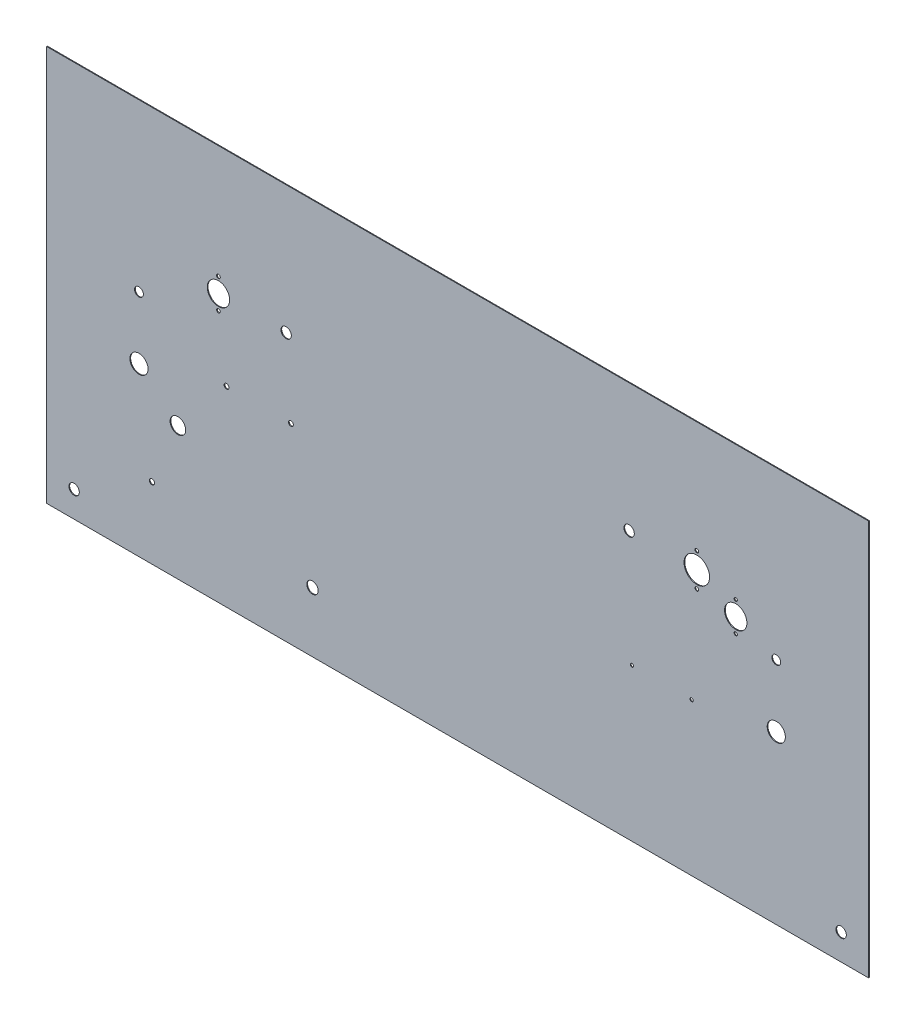
ISO-10303-21;
HEADER;
FILE_DESCRIPTION(('STEP AP214'),'2;1');
FILE_NAME('part.step','',(''),(''),'','','');
FILE_SCHEMA(('AUTOMOTIVE_DESIGN { 1 0 10303 214 1 1 1 1 }'));
ENDSEC;
DATA;
#1=APPLICATION_CONTEXT('core data for automotive mechanical design processes');
#2=APPLICATION_PROTOCOL_DEFINITION('international standard','automotive_design',2000,#1);
#3=PRODUCT_CONTEXT('',#1,'mechanical');
#4=PRODUCT('Part','Part','',(#3));
#5=PRODUCT_RELATED_PRODUCT_CATEGORY('part','',(#4));
#6=PRODUCT_DEFINITION_FORMATION('','',#4);
#7=PRODUCT_DEFINITION_CONTEXT('part definition',#1,'design');
#8=PRODUCT_DEFINITION('design','',#6,#7);
#9=PRODUCT_DEFINITION_SHAPE('','',#8);
#10=(LENGTH_UNIT() NAMED_UNIT(*) SI_UNIT(.MILLI.,.METRE.));
#11=(NAMED_UNIT(*) PLANE_ANGLE_UNIT() SI_UNIT($,.RADIAN.));
#12=(NAMED_UNIT(*) SI_UNIT($,.STERADIAN.) SOLID_ANGLE_UNIT());
#13=UNCERTAINTY_MEASURE_WITH_UNIT(LENGTH_MEASURE(1.E-05),#10,'distance_accuracy_value','');
#14=(GEOMETRIC_REPRESENTATION_CONTEXT(3) GLOBAL_UNCERTAINTY_ASSIGNED_CONTEXT((#13)) GLOBAL_UNIT_ASSIGNED_CONTEXT((#10,
#11,#12)) REPRESENTATION_CONTEXT('',''));
#15=CARTESIAN_POINT('',(0.,0.,0.));
#16=DIRECTION('',(0.,0.,1.));
#17=DIRECTION('',(1.,0.,0.));
#18=AXIS2_PLACEMENT_3D('',#15,#16,#17);
#19=CARTESIAN_POINT('',(777.875,4.4590924759535E-13,0.7366));
#20=DIRECTION('',(1.,0.,0.));
#21=DIRECTION('',(0.,1.,0.));
#22=AXIS2_PLACEMENT_3D('',#19,#20,#21);
#23=PLANE('',#22);
#24=DIRECTION('',(0.,-1.,0.));
#25=VECTOR('',#24,1.);
#26=CARTESIAN_POINT('',(777.875,4.4590924759535E-13,0.));
#27=LINE('',#26,#25);
#28=CARTESIAN_POINT('',(777.875,361.95,0.));
#29=VERTEX_POINT('',#28);
#30=CARTESIAN_POINT('',(777.875,-25.3999999999999,0.));
#31=VERTEX_POINT('',#30);
#32=EDGE_CURVE('E385',#29,#31,#27,.T.);
#33=ORIENTED_EDGE('',*,*,#32,.F.);
#34=DIRECTION('',(0.,0.,-1.));
#35=VECTOR('',#34,1.);
#36=CARTESIAN_POINT('',(777.875,361.95,0.7366));
#37=LINE('',#36,#35);
#38=CARTESIAN_POINT('',(777.875,361.95,0.7366));
#39=VERTEX_POINT('',#38);
#40=EDGE_CURVE('E12',#39,#29,#37,.T.);
#41=ORIENTED_EDGE('',*,*,#40,.F.);
#42=DIRECTION('',(0.,-1.,0.));
#43=VECTOR('',#42,1.);
#44=CARTESIAN_POINT('',(777.875,4.4590924759535E-13,0.7366));
#45=LINE('',#44,#43);
#46=CARTESIAN_POINT('',(777.875,-25.3999999999999,0.7366));
#47=VERTEX_POINT('',#46);
#48=EDGE_CURVE('E97',#39,#47,#45,.T.);
#49=ORIENTED_EDGE('',*,*,#48,.T.);
#50=DIRECTION('',(0.,0.,-1.));
#51=VECTOR('',#50,1.);
#52=CARTESIAN_POINT('',(777.875,-25.3999999999999,0.7366));
#53=LINE('',#52,#51);
#54=EDGE_CURVE('E79',#47,#31,#53,.T.);
#55=ORIENTED_EDGE('',*,*,#54,.T.);
#56=EDGE_LOOP('',(#33,#41,#49,#55));
#57=FACE_BOUND('',#56,.T.);
#58=ADVANCED_FACE('F40',(#57),#23,.T.);
#59=CARTESIAN_POINT('',(0.,361.95,0.7366));
#60=DIRECTION('',(0.,1.,0.));
#61=DIRECTION('',(0.,0.,1.));
#62=AXIS2_PLACEMENT_3D('',#59,#60,#61);
#63=PLANE('',#62);
#64=DIRECTION('',(1.,0.,0.));
#65=VECTOR('',#64,1.);
#66=CARTESIAN_POINT('',(0.,361.95,0.));
#67=LINE('',#66,#65);
#68=CARTESIAN_POINT('',(-26.9875,361.95,0.));
#69=VERTEX_POINT('',#68);
#70=EDGE_CURVE('E90',#69,#29,#67,.T.);
#71=ORIENTED_EDGE('',*,*,#70,.F.);
#72=DIRECTION('',(0.,0.,-1.));
#73=VECTOR('',#72,1.);
#74=CARTESIAN_POINT('',(-26.9875,361.95,0.7366));
#75=LINE('',#74,#73);
#76=CARTESIAN_POINT('',(-26.9875,361.95,0.7366));
#77=VERTEX_POINT('',#76);
#78=EDGE_CURVE('E49',#77,#69,#75,.T.);
#79=ORIENTED_EDGE('',*,*,#78,.F.);
#80=DIRECTION('',(1.,0.,0.));
#81=VECTOR('',#80,1.);
#82=CARTESIAN_POINT('',(0.,361.95,0.7366));
#83=LINE('',#82,#81);
#84=EDGE_CURVE('E88',#77,#39,#83,.T.);
#85=ORIENTED_EDGE('',*,*,#84,.T.);
#86=ORIENTED_EDGE('',*,*,#40,.T.);
#87=EDGE_LOOP('',(#71,#79,#85,#86));
#88=FACE_BOUND('',#87,.T.);
#89=ADVANCED_FACE('F87',(#88),#63,.T.);
#90=CARTESIAN_POINT('',(-26.9875,0.,0.7366));
#91=DIRECTION('',(-1.,0.,0.));
#92=DIRECTION('',(0.,-1.,0.));
#93=AXIS2_PLACEMENT_3D('',#90,#91,#92);
#94=PLANE('',#93);
#95=DIRECTION('',(0.,1.,0.));
#96=VECTOR('',#95,1.);
#97=CARTESIAN_POINT('',(-26.9875,0.,0.));
#98=LINE('',#97,#96);
#99=CARTESIAN_POINT('',(-26.9875,-25.4,0.));
#100=VERTEX_POINT('',#99);
#101=EDGE_CURVE('E396',#100,#69,#98,.T.);
#102=ORIENTED_EDGE('',*,*,#101,.F.);
#103=DIRECTION('',(0.,0.,-1.));
#104=VECTOR('',#103,1.);
#105=CARTESIAN_POINT('',(-26.9875,-25.4,0.7366));
#106=LINE('',#105,#104);
#107=CARTESIAN_POINT('',(-26.9875,-25.4,0.7366));
#108=VERTEX_POINT('',#107);
#109=EDGE_CURVE('E72',#108,#100,#106,.T.);
#110=ORIENTED_EDGE('',*,*,#109,.F.);
#111=DIRECTION('',(0.,1.,0.));
#112=VECTOR('',#111,1.);
#113=CARTESIAN_POINT('',(-26.9875,0.,0.7366));
#114=LINE('',#113,#112);
#115=EDGE_CURVE('E96',#108,#77,#114,.T.);
#116=ORIENTED_EDGE('',*,*,#115,.T.);
#117=ORIENTED_EDGE('',*,*,#78,.T.);
#118=EDGE_LOOP('',(#102,#110,#116,#117));
#119=FACE_BOUND('',#118,.T.);
#120=ADVANCED_FACE('F100',(#119),#94,.T.);
#121=CARTESIAN_POINT('',(0.,0.,0.7366));
#122=DIRECTION('',(0.,0.,-1.));
#123=DIRECTION('',(-1.,0.,0.));
#124=AXIS2_PLACEMENT_3D('',#121,#122,#123);
#125=CYLINDRICAL_SURFACE('',#124,5.08);
#126=CARTESIAN_POINT('',(0.,0.,0.7366));
#127=DIRECTION('',(0.,0.,1.));
#128=DIRECTION('',(1.,0.,0.));
#129=AXIS2_PLACEMENT_3D('',#126,#127,#128);
#130=CIRCLE('',#129,5.08);
#131=CARTESIAN_POINT('',(5.08,0.,0.7366));
#132=VERTEX_POINT('',#131);
#133=EDGE_CURVE('E116',#132,#132,#130,.T.);
#134=ORIENTED_EDGE('',*,*,#133,.T.);
#135=EDGE_LOOP('',(#134));
#136=FACE_BOUND('',#135,.T.);
#137=CARTESIAN_POINT('',(0.,0.,0.));
#138=DIRECTION('',(0.,0.,1.));
#139=DIRECTION('',(1.,0.,0.));
#140=AXIS2_PLACEMENT_3D('',#137,#138,#139);
#141=CIRCLE('',#140,5.08);
#142=CARTESIAN_POINT('',(5.08,0.,0.));
#143=VERTEX_POINT('',#142);
#144=EDGE_CURVE('E383',#143,#143,#141,.T.);
#145=ORIENTED_EDGE('',*,*,#144,.F.);
#146=EDGE_LOOP('',(#145));
#147=FACE_BOUND('',#146,.T.);
#148=ADVANCED_FACE('F376',(#136,#147),#125,.F.);
#149=CARTESIAN_POINT('',(750.8875,0.,0.7366));
#150=DIRECTION('',(0.,0.,-1.));
#151=DIRECTION('',(-1.,0.,0.));
#152=AXIS2_PLACEMENT_3D('',#149,#150,#151);
#153=CYLINDRICAL_SURFACE('',#152,5.08000000000002);
#154=CARTESIAN_POINT('',(750.8875,0.,0.7366));
#155=DIRECTION('',(0.,0.,1.));
#156=DIRECTION('',(1.,0.,0.));
#157=AXIS2_PLACEMENT_3D('',#154,#155,#156);
#158=CIRCLE('',#157,5.08000000000002);
#159=CARTESIAN_POINT('',(755.9675,0.,0.7366));
#160=VERTEX_POINT('',#159);
#161=EDGE_CURVE('E121',#160,#160,#158,.T.);
#162=ORIENTED_EDGE('',*,*,#161,.T.);
#163=EDGE_LOOP('',(#162));
#164=FACE_BOUND('',#163,.T.);
#165=CARTESIAN_POINT('',(750.8875,0.,0.));
#166=DIRECTION('',(0.,0.,1.));
#167=DIRECTION('',(1.,0.,0.));
#168=AXIS2_PLACEMENT_3D('',#165,#166,#167);
#169=CIRCLE('',#168,5.08000000000002);
#170=CARTESIAN_POINT('',(755.9675,0.,0.));
#171=VERTEX_POINT('',#170);
#172=EDGE_CURVE('E386',#171,#171,#169,.T.);
#173=ORIENTED_EDGE('',*,*,#172,.F.);
#174=EDGE_LOOP('',(#173));
#175=FACE_BOUND('',#174,.T.);
#176=ADVANCED_FACE('F379',(#164,#175),#153,.F.);
#177=CARTESIAN_POINT('',(207.565625,236.5375,0.7366));
#178=DIRECTION('',(0.,0.,-1.));
#179=DIRECTION('',(-1.,0.,0.));
#180=AXIS2_PLACEMENT_3D('',#177,#178,#179);
#181=CYLINDRICAL_SURFACE('',#180,5.07999999999999);
#182=CARTESIAN_POINT('',(207.565625,236.5375,0.7366));
#183=DIRECTION('',(0.,0.,1.));
#184=DIRECTION('',(1.,0.,0.));
#185=AXIS2_PLACEMENT_3D('',#182,#183,#184);
#186=CIRCLE('',#185,5.07999999999999);
#187=CARTESIAN_POINT('',(212.645625,236.5375,0.7366));
#188=VERTEX_POINT('',#187);
#189=EDGE_CURVE('E126',#188,#188,#186,.T.);
#190=ORIENTED_EDGE('',*,*,#189,.T.);
#191=EDGE_LOOP('',(#190));
#192=FACE_BOUND('',#191,.T.);
#193=CARTESIAN_POINT('',(207.565625,236.5375,0.));
#194=DIRECTION('',(0.,0.,1.));
#195=DIRECTION('',(1.,0.,0.));
#196=AXIS2_PLACEMENT_3D('',#193,#194,#195);
#197=CIRCLE('',#196,5.07999999999999);
#198=CARTESIAN_POINT('',(212.645625,236.5375,0.));
#199=VERTEX_POINT('',#198);
#200=EDGE_CURVE('E391',#199,#199,#197,.T.);
#201=ORIENTED_EDGE('',*,*,#200,.F.);
#202=EDGE_LOOP('',(#201));
#203=FACE_BOUND('',#202,.T.);
#204=ADVANCED_FACE('F410',(#192,#203),#181,.F.);
#205=CARTESIAN_POINT('',(543.321875,236.5375,0.7366));
#206=DIRECTION('',(0.,0.,-1.));
#207=DIRECTION('',(-1.,0.,0.));
#208=AXIS2_PLACEMENT_3D('',#205,#206,#207);
#209=CYLINDRICAL_SURFACE('',#208,5.08000000000002);
#210=CARTESIAN_POINT('',(543.321875,236.5375,0.7366));
#211=DIRECTION('',(0.,0.,1.));
#212=DIRECTION('',(1.,0.,0.));
#213=AXIS2_PLACEMENT_3D('',#210,#211,#212);
#214=CIRCLE('',#213,5.08000000000002);
#215=CARTESIAN_POINT('',(548.401875,236.5375,0.7366));
#216=VERTEX_POINT('',#215);
#217=EDGE_CURVE('E134',#216,#216,#214,.T.);
#218=ORIENTED_EDGE('',*,*,#217,.T.);
#219=EDGE_LOOP('',(#218));
#220=FACE_BOUND('',#219,.T.);
#221=CARTESIAN_POINT('',(543.321875,236.5375,0.));
#222=DIRECTION('',(0.,0.,1.));
#223=DIRECTION('',(1.,0.,0.));
#224=AXIS2_PLACEMENT_3D('',#221,#222,#223);
#225=CIRCLE('',#224,5.08000000000002);
#226=CARTESIAN_POINT('',(548.401875,236.5375,0.));
#227=VERTEX_POINT('',#226);
#228=EDGE_CURVE('E148',#227,#227,#225,.T.);
#229=ORIENTED_EDGE('',*,*,#228,.F.);
#230=EDGE_LOOP('',(#229));
#231=FACE_BOUND('',#230,.T.);
#232=ADVANCED_FACE('F42',(#220,#231),#209,.F.);
#233=CARTESIAN_POINT('',(0.,-25.4,0.7366));
#234=DIRECTION('',(0.,1.,0.));
#235=DIRECTION('',(-1.,0.,0.));
#236=AXIS2_PLACEMENT_3D('',#233,#234,#235);
#237=PLANE('',#236);
#238=DIRECTION('',(1.,0.,0.));
#239=VECTOR('',#238,1.);
#240=CARTESIAN_POINT('',(0.,-25.4,0.));
#241=LINE('',#240,#239);
#242=EDGE_CURVE('E138',#100,#31,#241,.T.);
#243=ORIENTED_EDGE('',*,*,#242,.T.);
#244=ORIENTED_EDGE('',*,*,#54,.F.);
#245=DIRECTION('',(1.,0.,0.));
#246=VECTOR('',#245,1.);
#247=CARTESIAN_POINT('',(0.,-25.4,0.7366));
#248=LINE('',#247,#246);
#249=EDGE_CURVE('E57',#108,#47,#248,.T.);
#250=ORIENTED_EDGE('',*,*,#249,.F.);
#251=ORIENTED_EDGE('',*,*,#109,.T.);
#252=EDGE_LOOP('',(#243,#244,#250,#251));
#253=FACE_BOUND('',#252,.T.);
#254=ADVANCED_FACE('F329',(#253),#237,.F.);
#255=CARTESIAN_POINT('',(0.,0.,0.7366));
#256=DIRECTION('',(0.,0.,1.));
#257=DIRECTION('',(1.,0.,0.));
#258=AXIS2_PLACEMENT_3D('',#255,#256,#257);
#259=PLANE('',#258);
#260=CARTESIAN_POINT('',(647.7,201.34961,0.7366));
#261=DIRECTION('',(0.,0.,1.));
#262=DIRECTION('',(1.,0.,0.));
#263=AXIS2_PLACEMENT_3D('',#260,#261,#262);
#264=CIRCLE('',#263,1.60020000000002);
#265=CARTESIAN_POINT('',(649.3002,201.34961,0.7366));
#266=VERTEX_POINT('',#265);
#267=EDGE_CURVE('E304',#266,#266,#264,.T.);
#268=ORIENTED_EDGE('',*,*,#267,.F.);
#269=EDGE_LOOP('',(#268));
#270=FACE_BOUND('',#269,.T.);
#271=CARTESIAN_POINT('',(647.7,230.45039,0.7366));
#272=DIRECTION('',(0.,0.,1.));
#273=DIRECTION('',(1.,0.,0.));
#274=AXIS2_PLACEMENT_3D('',#271,#272,#273);
#275=CIRCLE('',#274,1.60020000000002);
#276=CARTESIAN_POINT('',(649.3002,230.45039,0.7366));
#277=VERTEX_POINT('',#276);
#278=EDGE_CURVE('E311',#277,#277,#275,.T.);
#279=ORIENTED_EDGE('',*,*,#278,.F.);
#280=EDGE_LOOP('',(#279));
#281=FACE_BOUND('',#280,.T.);
#282=CARTESIAN_POINT('',(647.7,215.9,0.7366));
#283=DIRECTION('',(0.,0.,1.));
#284=DIRECTION('',(1.,0.,0.));
#285=AXIS2_PLACEMENT_3D('',#282,#283,#284);
#286=CIRCLE('',#285,10.94994);
#287=CARTESIAN_POINT('',(658.64994,215.9,0.7366));
#288=VERTEX_POINT('',#287);
#289=EDGE_CURVE('E297',#288,#288,#286,.T.);
#290=ORIENTED_EDGE('',*,*,#289,.F.);
#291=EDGE_LOOP('',(#290));
#292=FACE_BOUND('',#291,.T.);
#293=CARTESIAN_POINT('',(609.6,220.28785,0.7366));
#294=DIRECTION('',(0.,0.,1.));
#295=DIRECTION('',(1.,0.,0.));
#296=AXIS2_PLACEMENT_3D('',#293,#294,#295);
#297=CIRCLE('',#296,1.80340000000003);
#298=CARTESIAN_POINT('',(611.4034,220.28785,0.7366));
#299=VERTEX_POINT('',#298);
#300=EDGE_CURVE('E272',#299,#299,#297,.T.);
#301=ORIENTED_EDGE('',*,*,#300,.F.);
#302=EDGE_LOOP('',(#301));
#303=FACE_BOUND('',#302,.T.);
#304=CARTESIAN_POINT('',(609.6,252.78715,0.7366));
#305=DIRECTION('',(0.,0.,1.));
#306=DIRECTION('',(1.,0.,0.));
#307=AXIS2_PLACEMENT_3D('',#304,#305,#306);
#308=CIRCLE('',#307,1.80340000000004);
#309=CARTESIAN_POINT('',(611.4034,252.78715,0.7366));
#310=VERTEX_POINT('',#309);
#311=EDGE_CURVE('E280',#310,#310,#308,.T.);
#312=ORIENTED_EDGE('',*,*,#311,.F.);
#313=EDGE_LOOP('',(#312));
#314=FACE_BOUND('',#313,.T.);
#315=CARTESIAN_POINT('',(609.6,236.5375,0.7366));
#316=DIRECTION('',(0.,0.,1.));
#317=DIRECTION('',(1.,0.,0.));
#318=AXIS2_PLACEMENT_3D('',#315,#316,#317);
#319=CIRCLE('',#318,12.4968);
#320=CARTESIAN_POINT('',(622.0968,236.5375,0.7366));
#321=VERTEX_POINT('',#320);
#322=EDGE_CURVE('E265',#321,#321,#319,.T.);
#323=ORIENTED_EDGE('',*,*,#322,.F.);
#324=EDGE_LOOP('',(#323));
#325=FACE_BOUND('',#324,.T.);
#326=CARTESIAN_POINT('',(141.2875,251.08789,0.7366));
#327=DIRECTION('',(0.,0.,1.));
#328=DIRECTION('',(1.,0.,0.));
#329=AXIS2_PLACEMENT_3D('',#326,#327,#328);
#330=CIRCLE('',#329,1.80340000000002);
#331=CARTESIAN_POINT('',(143.0909,251.08789,0.7366));
#332=VERTEX_POINT('',#331);
#333=EDGE_CURVE('E256',#332,#332,#330,.T.);
#334=ORIENTED_EDGE('',*,*,#333,.F.);
#335=EDGE_LOOP('',(#334));
#336=FACE_BOUND('',#335,.T.);
#337=CARTESIAN_POINT('',(141.2875,221.98711,0.7366));
#338=DIRECTION('',(0.,0.,1.));
#339=DIRECTION('',(1.,0.,0.));
#340=AXIS2_PLACEMENT_3D('',#337,#338,#339);
#341=CIRCLE('',#340,1.80340000000001);
#342=CARTESIAN_POINT('',(143.0909,221.98711,0.7366));
#343=VERTEX_POINT('',#342);
#344=EDGE_CURVE('E247',#343,#343,#341,.T.);
#345=ORIENTED_EDGE('',*,*,#344,.F.);
#346=EDGE_LOOP('',(#345));
#347=FACE_BOUND('',#346,.T.);
#348=CARTESIAN_POINT('',(141.2875,236.5375,0.7366));
#349=DIRECTION('',(0.,0.,1.));
#350=DIRECTION('',(1.,0.,0.));
#351=AXIS2_PLACEMENT_3D('',#348,#349,#350);
#352=CIRCLE('',#351,10.94994);
#353=CARTESIAN_POINT('',(152.23744,236.5375,0.7366));
#354=VERTEX_POINT('',#353);
#355=EDGE_CURVE('E236',#354,#354,#352,.T.);
#356=ORIENTED_EDGE('',*,*,#355,.F.);
#357=EDGE_LOOP('',(#356));
#358=FACE_BOUND('',#357,.T.);
#359=CARTESIAN_POINT('',(546.1,123.825,0.7366));
#360=DIRECTION('',(0.,0.,1.));
#361=DIRECTION('',(1.,0.,0.));
#362=AXIS2_PLACEMENT_3D('',#359,#360,#361);
#363=CIRCLE('',#362,1.62559999999996);
#364=CARTESIAN_POINT('',(547.7256,123.825,0.7366));
#365=VERTEX_POINT('',#364);
#366=EDGE_CURVE('E229',#365,#365,#363,.T.);
#367=ORIENTED_EDGE('',*,*,#366,.F.);
#368=EDGE_LOOP('',(#367));
#369=FACE_BOUND('',#368,.T.);
#370=CARTESIAN_POINT('',(604.52,123.825,0.7366));
#371=DIRECTION('',(0.,0.,1.));
#372=DIRECTION('',(1.,0.,0.));
#373=AXIS2_PLACEMENT_3D('',#370,#371,#372);
#374=CIRCLE('',#373,1.62559999999996);
#375=CARTESIAN_POINT('',(606.1456,123.825,0.7366));
#376=VERTEX_POINT('',#375);
#377=EDGE_CURVE('E221',#376,#376,#374,.T.);
#378=ORIENTED_EDGE('',*,*,#377,.F.);
#379=EDGE_LOOP('',(#378));
#380=FACE_BOUND('',#379,.T.);
#381=CARTESIAN_POINT('',(101.6,104.775,0.7366));
#382=DIRECTION('',(0.,0.,1.));
#383=DIRECTION('',(1.,0.,0.));
#384=AXIS2_PLACEMENT_3D('',#381,#382,#383);
#385=CIRCLE('',#384,7.62);
#386=CARTESIAN_POINT('',(109.22,104.775,0.7366));
#387=VERTEX_POINT('',#386);
#388=EDGE_CURVE('E210',#387,#387,#385,.T.);
#389=ORIENTED_EDGE('',*,*,#388,.F.);
#390=EDGE_LOOP('',(#389));
#391=FACE_BOUND('',#390,.T.);
#392=CARTESIAN_POINT('',(233.3625,33.3375,0.7366));
#393=DIRECTION('',(0.,0.,1.));
#394=DIRECTION('',(1.,0.,0.));
#395=AXIS2_PLACEMENT_3D('',#392,#393,#394);
#396=CIRCLE('',#395,5.58800000000002);
#397=CARTESIAN_POINT('',(238.9505,33.3375,0.7366));
#398=VERTEX_POINT('',#397);
#399=EDGE_CURVE('E202',#398,#398,#396,.T.);
#400=ORIENTED_EDGE('',*,*,#399,.F.);
#401=EDGE_LOOP('',(#400));
#402=FACE_BOUND('',#401,.T.);
#403=CARTESIAN_POINT('',(76.2,44.45,0.7366));
#404=DIRECTION('',(0.,0.,1.));
#405=DIRECTION('',(1.,0.,0.));
#406=AXIS2_PLACEMENT_3D('',#403,#404,#405);
#407=CIRCLE('',#406,2.53999999999998);
#408=CARTESIAN_POINT('',(78.74,44.45,0.7366));
#409=VERTEX_POINT('',#408);
#410=EDGE_CURVE('E195',#409,#409,#407,.T.);
#411=ORIENTED_EDGE('',*,*,#410,.F.);
#412=EDGE_LOOP('',(#411));
#413=FACE_BOUND('',#412,.T.);
#414=CARTESIAN_POINT('',(149.225,161.925,0.7366));
#415=DIRECTION('',(0.,0.,1.));
#416=DIRECTION('',(1.,0.,0.));
#417=AXIS2_PLACEMENT_3D('',#414,#415,#416);
#418=CIRCLE('',#417,2.38125);
#419=CARTESIAN_POINT('',(151.60625,161.925,0.7366));
#420=VERTEX_POINT('',#419);
#421=EDGE_CURVE('E185',#420,#420,#418,.T.);
#422=ORIENTED_EDGE('',*,*,#421,.F.);
#423=EDGE_LOOP('',(#422));
#424=FACE_BOUND('',#423,.T.);
#425=CARTESIAN_POINT('',(212.217,161.925,0.7366));
#426=DIRECTION('',(0.,0.,1.));
#427=DIRECTION('',(1.,0.,0.));
#428=AXIS2_PLACEMENT_3D('',#425,#426,#427);
#429=CIRCLE('',#428,2.38125);
#430=CARTESIAN_POINT('',(214.59825,161.925,0.7366));
#431=VERTEX_POINT('',#430);
#432=EDGE_CURVE('E176',#431,#431,#429,.T.);
#433=ORIENTED_EDGE('',*,*,#432,.F.);
#434=EDGE_LOOP('',(#433));
#435=FACE_BOUND('',#434,.T.);
#436=CARTESIAN_POINT('',(687.3875,138.1125,0.7366));
#437=DIRECTION('',(0.,0.,1.));
#438=DIRECTION('',(-1.,0.,0.));
#439=AXIS2_PLACEMENT_3D('',#436,#437,#438);
#440=CIRCLE('',#439,8.89000000000011);
#441=CARTESIAN_POINT('',(678.4975,138.1125,0.7366));
#442=VERTEX_POINT('',#441);
#443=EDGE_CURVE('E149',#442,#442,#440,.T.);
#444=ORIENTED_EDGE('',*,*,#443,.F.);
#445=EDGE_LOOP('',(#444));
#446=FACE_BOUND('',#445,.T.);
#447=CARTESIAN_POINT('',(687.3875,199.0725,0.7366));
#448=DIRECTION('',(0.,0.,1.));
#449=DIRECTION('',(-1.,0.,0.));
#450=AXIS2_PLACEMENT_3D('',#447,#448,#449);
#451=CIRCLE('',#450,4.31799999999994);
#452=CARTESIAN_POINT('',(683.0695,199.0725,0.7366));
#453=VERTEX_POINT('',#452);
#454=EDGE_CURVE('E163',#453,#453,#451,.T.);
#455=ORIENTED_EDGE('',*,*,#454,.F.);
#456=EDGE_LOOP('',(#455));
#457=FACE_BOUND('',#456,.T.);
#458=CARTESIAN_POINT('',(63.5,199.0725,0.7366));
#459=DIRECTION('',(0.,0.,1.));
#460=DIRECTION('',(1.,0.,0.));
#461=AXIS2_PLACEMENT_3D('',#458,#459,#460);
#462=CIRCLE('',#461,4.318);
#463=CARTESIAN_POINT('',(67.818,199.0725,0.7366));
#464=VERTEX_POINT('',#463);
#465=EDGE_CURVE('E170',#464,#464,#462,.T.);
#466=ORIENTED_EDGE('',*,*,#465,.F.);
#467=EDGE_LOOP('',(#466));
#468=FACE_BOUND('',#467,.T.);
#469=CARTESIAN_POINT('',(63.5,138.1125,0.7366));
#470=DIRECTION('',(0.,0.,1.));
#471=DIRECTION('',(1.,0.,0.));
#472=AXIS2_PLACEMENT_3D('',#469,#470,#471);
#473=CIRCLE('',#472,8.89000000000002);
#474=CARTESIAN_POINT('',(72.39,138.1125,0.7366));
#475=VERTEX_POINT('',#474);
#476=EDGE_CURVE('E139',#475,#475,#473,.T.);
#477=ORIENTED_EDGE('',*,*,#476,.F.);
#478=EDGE_LOOP('',(#477));
#479=FACE_BOUND('',#478,.T.);
#480=ORIENTED_EDGE('',*,*,#217,.F.);
#481=EDGE_LOOP('',(#480));
#482=FACE_BOUND('',#481,.T.);
#483=ORIENTED_EDGE('',*,*,#189,.F.);
#484=EDGE_LOOP('',(#483));
#485=FACE_BOUND('',#484,.T.);
#486=ORIENTED_EDGE('',*,*,#161,.F.);
#487=EDGE_LOOP('',(#486));
#488=FACE_BOUND('',#487,.T.);
#489=ORIENTED_EDGE('',*,*,#133,.F.);
#490=EDGE_LOOP('',(#489));
#491=FACE_BOUND('',#490,.T.);
#492=ORIENTED_EDGE('',*,*,#48,.F.);
#493=ORIENTED_EDGE('',*,*,#84,.F.);
#494=ORIENTED_EDGE('',*,*,#115,.F.);
#495=ORIENTED_EDGE('',*,*,#249,.T.);
#496=EDGE_LOOP('',(#492,#493,#494,#495));
#497=FACE_BOUND('',#496,.T.);
#498=ADVANCED_FACE('F95',(#270,#281,#292,#303,#314,#325,#336,#347,#358,#369,#380,#391,#402,#413,
#424,#435,#446,#457,#468,#479,#482,#485,#488,#491,#497),#259,.T.);
#499=CARTESIAN_POINT('',(0.,0.,0.));
#500=DIRECTION('',(0.,0.,1.));
#501=DIRECTION('',(1.,0.,0.));
#502=AXIS2_PLACEMENT_3D('',#499,#500,#501);
#503=PLANE('',#502);
#504=CARTESIAN_POINT('',(647.7,201.34961,0.));
#505=DIRECTION('',(0.,0.,1.));
#506=DIRECTION('',(1.,0.,0.));
#507=AXIS2_PLACEMENT_3D('',#504,#505,#506);
#508=CIRCLE('',#507,1.60020000000002);
#509=CARTESIAN_POINT('',(649.3002,201.34961,0.));
#510=VERTEX_POINT('',#509);
#511=EDGE_CURVE('E316',#510,#510,#508,.T.);
#512=ORIENTED_EDGE('',*,*,#511,.T.);
#513=EDGE_LOOP('',(#512));
#514=FACE_BOUND('',#513,.T.);
#515=CARTESIAN_POINT('',(647.7,230.45039,0.));
#516=DIRECTION('',(0.,0.,1.));
#517=DIRECTION('',(1.,0.,0.));
#518=AXIS2_PLACEMENT_3D('',#515,#516,#517);
#519=CIRCLE('',#518,1.60020000000002);
#520=CARTESIAN_POINT('',(649.3002,230.45039,0.));
#521=VERTEX_POINT('',#520);
#522=EDGE_CURVE('E302',#521,#521,#519,.T.);
#523=ORIENTED_EDGE('',*,*,#522,.T.);
#524=EDGE_LOOP('',(#523));
#525=FACE_BOUND('',#524,.T.);
#526=CARTESIAN_POINT('',(647.7,215.9,0.));
#527=DIRECTION('',(0.,0.,1.));
#528=DIRECTION('',(1.,0.,0.));
#529=AXIS2_PLACEMENT_3D('',#526,#527,#528);
#530=CIRCLE('',#529,10.94994);
#531=CARTESIAN_POINT('',(658.64994,215.9,0.));
#532=VERTEX_POINT('',#531);
#533=EDGE_CURVE('E292',#532,#532,#530,.T.);
#534=ORIENTED_EDGE('',*,*,#533,.T.);
#535=EDGE_LOOP('',(#534));
#536=FACE_BOUND('',#535,.T.);
#537=CARTESIAN_POINT('',(609.6,220.28785,0.));
#538=DIRECTION('',(0.,0.,1.));
#539=DIRECTION('',(1.,0.,0.));
#540=AXIS2_PLACEMENT_3D('',#537,#538,#539);
#541=CIRCLE('',#540,1.80340000000003);
#542=CARTESIAN_POINT('',(611.4034,220.28785,0.));
#543=VERTEX_POINT('',#542);
#544=EDGE_CURVE('E285',#543,#543,#541,.T.);
#545=ORIENTED_EDGE('',*,*,#544,.T.);
#546=EDGE_LOOP('',(#545));
#547=FACE_BOUND('',#546,.T.);
#548=CARTESIAN_POINT('',(609.6,252.78715,0.));
#549=DIRECTION('',(0.,0.,1.));
#550=DIRECTION('',(1.,0.,0.));
#551=AXIS2_PLACEMENT_3D('',#548,#549,#550);
#552=CIRCLE('',#551,1.80340000000004);
#553=CARTESIAN_POINT('',(611.4034,252.78715,0.));
#554=VERTEX_POINT('',#553);
#555=EDGE_CURVE('E270',#554,#554,#552,.T.);
#556=ORIENTED_EDGE('',*,*,#555,.T.);
#557=EDGE_LOOP('',(#556));
#558=FACE_BOUND('',#557,.T.);
#559=CARTESIAN_POINT('',(609.6,236.5375,0.));
#560=DIRECTION('',(0.,0.,1.));
#561=DIRECTION('',(1.,0.,0.));
#562=AXIS2_PLACEMENT_3D('',#559,#560,#561);
#563=CIRCLE('',#562,12.4968);
#564=CARTESIAN_POINT('',(622.0968,236.5375,0.));
#565=VERTEX_POINT('',#564);
#566=EDGE_CURVE('E260',#565,#565,#563,.T.);
#567=ORIENTED_EDGE('',*,*,#566,.T.);
#568=EDGE_LOOP('',(#567));
#569=FACE_BOUND('',#568,.T.);
#570=CARTESIAN_POINT('',(141.2875,251.08789,0.));
#571=DIRECTION('',(0.,0.,1.));
#572=DIRECTION('',(1.,0.,0.));
#573=AXIS2_PLACEMENT_3D('',#570,#571,#572);
#574=CIRCLE('',#573,1.80340000000002);
#575=CARTESIAN_POINT('',(143.0909,251.08789,0.));
#576=VERTEX_POINT('',#575);
#577=EDGE_CURVE('E253',#576,#576,#574,.T.);
#578=ORIENTED_EDGE('',*,*,#577,.T.);
#579=EDGE_LOOP('',(#578));
#580=FACE_BOUND('',#579,.T.);
#581=CARTESIAN_POINT('',(141.2875,221.98711,0.));
#582=DIRECTION('',(0.,0.,1.));
#583=DIRECTION('',(1.,0.,0.));
#584=AXIS2_PLACEMENT_3D('',#581,#582,#583);
#585=CIRCLE('',#584,1.80340000000001);
#586=CARTESIAN_POINT('',(143.0909,221.98711,0.));
#587=VERTEX_POINT('',#586);
#588=EDGE_CURVE('E241',#587,#587,#585,.T.);
#589=ORIENTED_EDGE('',*,*,#588,.T.);
#590=EDGE_LOOP('',(#589));
#591=FACE_BOUND('',#590,.T.);
#592=CARTESIAN_POINT('',(141.2875,236.5375,0.));
#593=DIRECTION('',(0.,0.,1.));
#594=DIRECTION('',(1.,0.,0.));
#595=AXIS2_PLACEMENT_3D('',#592,#593,#594);
#596=CIRCLE('',#595,10.94994);
#597=CARTESIAN_POINT('',(152.23744,236.5375,0.));
#598=VERTEX_POINT('',#597);
#599=EDGE_CURVE('E227',#598,#598,#596,.T.);
#600=ORIENTED_EDGE('',*,*,#599,.T.);
#601=EDGE_LOOP('',(#600));
#602=FACE_BOUND('',#601,.T.);
#603=CARTESIAN_POINT('',(546.1,123.825,0.));
#604=DIRECTION('',(0.,0.,1.));
#605=DIRECTION('',(1.,0.,0.));
#606=AXIS2_PLACEMENT_3D('',#603,#604,#605);
#607=CIRCLE('',#606,1.62559999999996);
#608=CARTESIAN_POINT('',(547.7256,123.825,0.));
#609=VERTEX_POINT('',#608);
#610=EDGE_CURVE('E215',#609,#609,#607,.T.);
#611=ORIENTED_EDGE('',*,*,#610,.T.);
#612=EDGE_LOOP('',(#611));
#613=FACE_BOUND('',#612,.T.);
#614=CARTESIAN_POINT('',(604.52,123.825,0.));
#615=DIRECTION('',(0.,0.,1.));
#616=DIRECTION('',(1.,0.,0.));
#617=AXIS2_PLACEMENT_3D('',#614,#615,#616);
#618=CIRCLE('',#617,1.62559999999996);
#619=CARTESIAN_POINT('',(606.1456,123.825,0.));
#620=VERTEX_POINT('',#619);
#621=EDGE_CURVE('E226',#620,#620,#618,.T.);
#622=ORIENTED_EDGE('',*,*,#621,.T.);
#623=EDGE_LOOP('',(#622));
#624=FACE_BOUND('',#623,.T.);
#625=CARTESIAN_POINT('',(101.6,104.775,0.));
#626=DIRECTION('',(0.,0.,1.));
#627=DIRECTION('',(1.,0.,0.));
#628=AXIS2_PLACEMENT_3D('',#625,#626,#627);
#629=CIRCLE('',#628,7.62);
#630=CARTESIAN_POINT('',(109.22,104.775,0.));
#631=VERTEX_POINT('',#630);
#632=EDGE_CURVE('E207',#631,#631,#629,.T.);
#633=ORIENTED_EDGE('',*,*,#632,.T.);
#634=EDGE_LOOP('',(#633));
#635=FACE_BOUND('',#634,.T.);
#636=CARTESIAN_POINT('',(233.3625,33.3375,0.));
#637=DIRECTION('',(0.,0.,1.));
#638=DIRECTION('',(1.,0.,0.));
#639=AXIS2_PLACEMENT_3D('',#636,#637,#638);
#640=CIRCLE('',#639,5.58800000000002);
#641=CARTESIAN_POINT('',(238.9505,33.3375,0.));
#642=VERTEX_POINT('',#641);
#643=EDGE_CURVE('E200',#642,#642,#640,.T.);
#644=ORIENTED_EDGE('',*,*,#643,.T.);
#645=EDGE_LOOP('',(#644));
#646=FACE_BOUND('',#645,.T.);
#647=CARTESIAN_POINT('',(76.2,44.45,0.));
#648=DIRECTION('',(0.,0.,1.));
#649=DIRECTION('',(1.,0.,0.));
#650=AXIS2_PLACEMENT_3D('',#647,#648,#649);
#651=CIRCLE('',#650,2.53999999999998);
#652=CARTESIAN_POINT('',(78.74,44.45,0.));
#653=VERTEX_POINT('',#652);
#654=EDGE_CURVE('E182',#653,#653,#651,.T.);
#655=ORIENTED_EDGE('',*,*,#654,.T.);
#656=EDGE_LOOP('',(#655));
#657=FACE_BOUND('',#656,.T.);
#658=CARTESIAN_POINT('',(149.225,161.925,0.));
#659=DIRECTION('',(0.,0.,1.));
#660=DIRECTION('',(1.,0.,0.));
#661=AXIS2_PLACEMENT_3D('',#658,#659,#660);
#662=CIRCLE('',#661,2.38125);
#663=CARTESIAN_POINT('',(151.60625,161.925,0.));
#664=VERTEX_POINT('',#663);
#665=EDGE_CURVE('E155',#664,#664,#662,.T.);
#666=ORIENTED_EDGE('',*,*,#665,.T.);
#667=EDGE_LOOP('',(#666));
#668=FACE_BOUND('',#667,.T.);
#669=CARTESIAN_POINT('',(212.217,161.925,0.));
#670=DIRECTION('',(0.,0.,1.));
#671=DIRECTION('',(1.,0.,0.));
#672=AXIS2_PLACEMENT_3D('',#669,#670,#671);
#673=CIRCLE('',#672,2.38125);
#674=CARTESIAN_POINT('',(214.59825,161.925,0.));
#675=VERTEX_POINT('',#674);
#676=EDGE_CURVE('E181',#675,#675,#673,.T.);
#677=ORIENTED_EDGE('',*,*,#676,.T.);
#678=EDGE_LOOP('',(#677));
#679=FACE_BOUND('',#678,.T.);
#680=CARTESIAN_POINT('',(687.3875,138.1125,0.));
#681=DIRECTION('',(0.,0.,1.));
#682=DIRECTION('',(-1.,0.,0.));
#683=AXIS2_PLACEMENT_3D('',#680,#681,#682);
#684=CIRCLE('',#683,8.89000000000011);
#685=CARTESIAN_POINT('',(678.4975,138.1125,0.));
#686=VERTEX_POINT('',#685);
#687=EDGE_CURVE('E154',#686,#686,#684,.T.);
#688=ORIENTED_EDGE('',*,*,#687,.T.);
#689=EDGE_LOOP('',(#688));
#690=FACE_BOUND('',#689,.T.);
#691=CARTESIAN_POINT('',(687.3875,199.0725,0.));
#692=DIRECTION('',(0.,0.,1.));
#693=DIRECTION('',(-1.,0.,0.));
#694=AXIS2_PLACEMENT_3D('',#691,#692,#693);
#695=CIRCLE('',#694,4.31799999999994);
#696=CARTESIAN_POINT('',(683.0695,199.0725,0.));
#697=VERTEX_POINT('',#696);
#698=EDGE_CURVE('E168',#697,#697,#695,.T.);
#699=ORIENTED_EDGE('',*,*,#698,.T.);
#700=EDGE_LOOP('',(#699));
#701=FACE_BOUND('',#700,.T.);
#702=CARTESIAN_POINT('',(63.5,199.0725,0.));
#703=DIRECTION('',(0.,0.,1.));
#704=DIRECTION('',(1.,0.,0.));
#705=AXIS2_PLACEMENT_3D('',#702,#703,#704);
#706=CIRCLE('',#705,4.318);
#707=CARTESIAN_POINT('',(67.818,199.0725,0.));
#708=VERTEX_POINT('',#707);
#709=EDGE_CURVE('E145',#708,#708,#706,.T.);
#710=ORIENTED_EDGE('',*,*,#709,.T.);
#711=EDGE_LOOP('',(#710));
#712=FACE_BOUND('',#711,.T.);
#713=CARTESIAN_POINT('',(63.5,138.1125,0.));
#714=DIRECTION('',(0.,0.,1.));
#715=DIRECTION('',(1.,0.,0.));
#716=AXIS2_PLACEMENT_3D('',#713,#714,#715);
#717=CIRCLE('',#716,8.89000000000002);
#718=CARTESIAN_POINT('',(72.39,138.1125,0.));
#719=VERTEX_POINT('',#718);
#720=EDGE_CURVE('E144',#719,#719,#717,.T.);
#721=ORIENTED_EDGE('',*,*,#720,.T.);
#722=EDGE_LOOP('',(#721));
#723=FACE_BOUND('',#722,.T.);
#724=ORIENTED_EDGE('',*,*,#228,.T.);
#725=EDGE_LOOP('',(#724));
#726=FACE_BOUND('',#725,.T.);
#727=ORIENTED_EDGE('',*,*,#200,.T.);
#728=EDGE_LOOP('',(#727));
#729=FACE_BOUND('',#728,.T.);
#730=ORIENTED_EDGE('',*,*,#172,.T.);
#731=EDGE_LOOP('',(#730));
#732=FACE_BOUND('',#731,.T.);
#733=ORIENTED_EDGE('',*,*,#144,.T.);
#734=EDGE_LOOP('',(#733));
#735=FACE_BOUND('',#734,.T.);
#736=ORIENTED_EDGE('',*,*,#32,.T.);
#737=ORIENTED_EDGE('',*,*,#242,.F.);
#738=ORIENTED_EDGE('',*,*,#101,.T.);
#739=ORIENTED_EDGE('',*,*,#70,.T.);
#740=EDGE_LOOP('',(#736,#737,#738,#739));
#741=FACE_BOUND('',#740,.T.);
#742=ADVANCED_FACE('F328',(#514,#525,#536,#547,#558,#569,#580,#591,#602,#613,#624,#635,#646,
#657,#668,#679,#690,#701,#712,#723,#726,#729,#732,#735,#741),#503,.F.);
#743=CARTESIAN_POINT('',(63.5,138.1125,0.));
#744=DIRECTION('',(0.,0.,1.));
#745=DIRECTION('',(1.,0.,0.));
#746=AXIS2_PLACEMENT_3D('',#743,#744,#745);
#747=CYLINDRICAL_SURFACE('',#746,8.89000000000002);
#748=ORIENTED_EDGE('',*,*,#720,.F.);
#749=EDGE_LOOP('',(#748));
#750=FACE_BOUND('',#749,.T.);
#751=ORIENTED_EDGE('',*,*,#476,.T.);
#752=EDGE_LOOP('',(#751));
#753=FACE_BOUND('',#752,.T.);
#754=ADVANCED_FACE('F427',(#750,#753),#747,.F.);
#755=CARTESIAN_POINT('',(63.5,199.0725,0.));
#756=DIRECTION('',(0.,0.,1.));
#757=DIRECTION('',(1.,0.,0.));
#758=AXIS2_PLACEMENT_3D('',#755,#756,#757);
#759=CYLINDRICAL_SURFACE('',#758,4.318);
#760=ORIENTED_EDGE('',*,*,#709,.F.);
#761=EDGE_LOOP('',(#760));
#762=FACE_BOUND('',#761,.T.);
#763=ORIENTED_EDGE('',*,*,#465,.T.);
#764=EDGE_LOOP('',(#763));
#765=FACE_BOUND('',#764,.T.);
#766=ADVANCED_FACE('F435',(#762,#765),#759,.F.);
#767=CARTESIAN_POINT('',(687.3875,199.0725,0.));
#768=DIRECTION('',(0.,0.,1.));
#769=DIRECTION('',(1.,0.,0.));
#770=AXIS2_PLACEMENT_3D('',#767,#768,#769);
#771=CYLINDRICAL_SURFACE('',#770,4.31799999999994);
#772=ORIENTED_EDGE('',*,*,#698,.F.);
#773=EDGE_LOOP('',(#772));
#774=FACE_BOUND('',#773,.T.);
#775=ORIENTED_EDGE('',*,*,#454,.T.);
#776=EDGE_LOOP('',(#775));
#777=FACE_BOUND('',#776,.T.);
#778=ADVANCED_FACE('F487',(#774,#777),#771,.F.);
#779=CARTESIAN_POINT('',(687.3875,138.1125,0.));
#780=DIRECTION('',(0.,0.,1.));
#781=DIRECTION('',(1.,0.,0.));
#782=AXIS2_PLACEMENT_3D('',#779,#780,#781);
#783=CYLINDRICAL_SURFACE('',#782,8.89000000000011);
#784=ORIENTED_EDGE('',*,*,#687,.F.);
#785=EDGE_LOOP('',(#784));
#786=FACE_BOUND('',#785,.T.);
#787=ORIENTED_EDGE('',*,*,#443,.T.);
#788=EDGE_LOOP('',(#787));
#789=FACE_BOUND('',#788,.T.);
#790=ADVANCED_FACE('F497',(#786,#789),#783,.F.);
#791=CARTESIAN_POINT('',(212.217,161.925,0.));
#792=DIRECTION('',(0.,0.,1.));
#793=DIRECTION('',(1.,0.,0.));
#794=AXIS2_PLACEMENT_3D('',#791,#792,#793);
#795=CYLINDRICAL_SURFACE('',#794,2.38125);
#796=ORIENTED_EDGE('',*,*,#676,.F.);
#797=EDGE_LOOP('',(#796));
#798=FACE_BOUND('',#797,.T.);
#799=ORIENTED_EDGE('',*,*,#432,.T.);
#800=EDGE_LOOP('',(#799));
#801=FACE_BOUND('',#800,.T.);
#802=ADVANCED_FACE('F507',(#798,#801),#795,.F.);
#803=CARTESIAN_POINT('',(149.225,161.925,0.));
#804=DIRECTION('',(0.,0.,1.));
#805=DIRECTION('',(1.,0.,0.));
#806=AXIS2_PLACEMENT_3D('',#803,#804,#805);
#807=CYLINDRICAL_SURFACE('',#806,2.38125);
#808=ORIENTED_EDGE('',*,*,#665,.F.);
#809=EDGE_LOOP('',(#808));
#810=FACE_BOUND('',#809,.T.);
#811=ORIENTED_EDGE('',*,*,#421,.T.);
#812=EDGE_LOOP('',(#811));
#813=FACE_BOUND('',#812,.T.);
#814=ADVANCED_FACE('F517',(#810,#813),#807,.F.);
#815=CARTESIAN_POINT('',(76.2,44.45,0.));
#816=DIRECTION('',(0.,0.,1.));
#817=DIRECTION('',(1.,0.,0.));
#818=AXIS2_PLACEMENT_3D('',#815,#816,#817);
#819=CYLINDRICAL_SURFACE('',#818,2.53999999999998);
#820=ORIENTED_EDGE('',*,*,#654,.F.);
#821=EDGE_LOOP('',(#820));
#822=FACE_BOUND('',#821,.T.);
#823=ORIENTED_EDGE('',*,*,#410,.T.);
#824=EDGE_LOOP('',(#823));
#825=FACE_BOUND('',#824,.T.);
#826=ADVANCED_FACE('F527',(#822,#825),#819,.F.);
#827=CARTESIAN_POINT('',(233.3625,33.3375,0.));
#828=DIRECTION('',(0.,0.,1.));
#829=DIRECTION('',(1.,0.,0.));
#830=AXIS2_PLACEMENT_3D('',#827,#828,#829);
#831=CYLINDRICAL_SURFACE('',#830,5.58800000000002);
#832=ORIENTED_EDGE('',*,*,#643,.F.);
#833=EDGE_LOOP('',(#832));
#834=FACE_BOUND('',#833,.T.);
#835=ORIENTED_EDGE('',*,*,#399,.T.);
#836=EDGE_LOOP('',(#835));
#837=FACE_BOUND('',#836,.T.);
#838=ADVANCED_FACE('F537',(#834,#837),#831,.F.);
#839=CARTESIAN_POINT('',(101.6,104.775,0.));
#840=DIRECTION('',(0.,0.,1.));
#841=DIRECTION('',(1.,0.,0.));
#842=AXIS2_PLACEMENT_3D('',#839,#840,#841);
#843=CYLINDRICAL_SURFACE('',#842,7.62);
#844=ORIENTED_EDGE('',*,*,#632,.F.);
#845=EDGE_LOOP('',(#844));
#846=FACE_BOUND('',#845,.T.);
#847=ORIENTED_EDGE('',*,*,#388,.T.);
#848=EDGE_LOOP('',(#847));
#849=FACE_BOUND('',#848,.T.);
#850=ADVANCED_FACE('F547',(#846,#849),#843,.F.);
#851=CARTESIAN_POINT('',(604.52,123.825,0.));
#852=DIRECTION('',(0.,0.,1.));
#853=DIRECTION('',(1.,0.,0.));
#854=AXIS2_PLACEMENT_3D('',#851,#852,#853);
#855=CYLINDRICAL_SURFACE('',#854,1.62559999999996);
#856=ORIENTED_EDGE('',*,*,#621,.F.);
#857=EDGE_LOOP('',(#856));
#858=FACE_BOUND('',#857,.T.);
#859=ORIENTED_EDGE('',*,*,#377,.T.);
#860=EDGE_LOOP('',(#859));
#861=FACE_BOUND('',#860,.T.);
#862=ADVANCED_FACE('F557',(#858,#861),#855,.F.);
#863=CARTESIAN_POINT('',(546.1,123.825,0.));
#864=DIRECTION('',(0.,0.,1.));
#865=DIRECTION('',(1.,0.,0.));
#866=AXIS2_PLACEMENT_3D('',#863,#864,#865);
#867=CYLINDRICAL_SURFACE('',#866,1.62559999999996);
#868=ORIENTED_EDGE('',*,*,#610,.F.);
#869=EDGE_LOOP('',(#868));
#870=FACE_BOUND('',#869,.T.);
#871=ORIENTED_EDGE('',*,*,#366,.T.);
#872=EDGE_LOOP('',(#871));
#873=FACE_BOUND('',#872,.T.);
#874=ADVANCED_FACE('F567',(#870,#873),#867,.F.);
#875=CARTESIAN_POINT('',(141.2875,236.5375,0.));
#876=DIRECTION('',(0.,0.,1.));
#877=DIRECTION('',(1.,0.,0.));
#878=AXIS2_PLACEMENT_3D('',#875,#876,#877);
#879=CYLINDRICAL_SURFACE('',#878,10.94994);
#880=ORIENTED_EDGE('',*,*,#599,.F.);
#881=EDGE_LOOP('',(#880));
#882=FACE_BOUND('',#881,.T.);
#883=ORIENTED_EDGE('',*,*,#355,.T.);
#884=EDGE_LOOP('',(#883));
#885=FACE_BOUND('',#884,.T.);
#886=ADVANCED_FACE('F577',(#882,#885),#879,.F.);
#887=CARTESIAN_POINT('',(141.2875,221.98711,0.));
#888=DIRECTION('',(0.,0.,1.));
#889=DIRECTION('',(1.,0.,0.));
#890=AXIS2_PLACEMENT_3D('',#887,#888,#889);
#891=CYLINDRICAL_SURFACE('',#890,1.80340000000001);
#892=ORIENTED_EDGE('',*,*,#588,.F.);
#893=EDGE_LOOP('',(#892));
#894=FACE_BOUND('',#893,.T.);
#895=ORIENTED_EDGE('',*,*,#344,.T.);
#896=EDGE_LOOP('',(#895));
#897=FACE_BOUND('',#896,.T.);
#898=ADVANCED_FACE('F587',(#894,#897),#891,.F.);
#899=CARTESIAN_POINT('',(141.2875,251.08789,0.));
#900=DIRECTION('',(0.,0.,1.));
#901=DIRECTION('',(1.,0.,0.));
#902=AXIS2_PLACEMENT_3D('',#899,#900,#901);
#903=CYLINDRICAL_SURFACE('',#902,1.80340000000002);
#904=ORIENTED_EDGE('',*,*,#577,.F.);
#905=EDGE_LOOP('',(#904));
#906=FACE_BOUND('',#905,.T.);
#907=ORIENTED_EDGE('',*,*,#333,.T.);
#908=EDGE_LOOP('',(#907));
#909=FACE_BOUND('',#908,.T.);
#910=ADVANCED_FACE('F597',(#906,#909),#903,.F.);
#911=CARTESIAN_POINT('',(609.6,236.5375,0.));
#912=DIRECTION('',(0.,0.,1.));
#913=DIRECTION('',(1.,0.,0.));
#914=AXIS2_PLACEMENT_3D('',#911,#912,#913);
#915=CYLINDRICAL_SURFACE('',#914,12.4968);
#916=ORIENTED_EDGE('',*,*,#566,.F.);
#917=EDGE_LOOP('',(#916));
#918=FACE_BOUND('',#917,.T.);
#919=ORIENTED_EDGE('',*,*,#322,.T.);
#920=EDGE_LOOP('',(#919));
#921=FACE_BOUND('',#920,.T.);
#922=ADVANCED_FACE('F607',(#918,#921),#915,.F.);
#923=CARTESIAN_POINT('',(609.6,252.78715,0.));
#924=DIRECTION('',(0.,0.,1.));
#925=DIRECTION('',(1.,0.,0.));
#926=AXIS2_PLACEMENT_3D('',#923,#924,#925);
#927=CYLINDRICAL_SURFACE('',#926,1.80340000000004);
#928=ORIENTED_EDGE('',*,*,#555,.F.);
#929=EDGE_LOOP('',(#928));
#930=FACE_BOUND('',#929,.T.);
#931=ORIENTED_EDGE('',*,*,#311,.T.);
#932=EDGE_LOOP('',(#931));
#933=FACE_BOUND('',#932,.T.);
#934=ADVANCED_FACE('F617',(#930,#933),#927,.F.);
#935=CARTESIAN_POINT('',(609.6,220.28785,0.));
#936=DIRECTION('',(0.,0.,1.));
#937=DIRECTION('',(1.,0.,0.));
#938=AXIS2_PLACEMENT_3D('',#935,#936,#937);
#939=CYLINDRICAL_SURFACE('',#938,1.80340000000003);
#940=ORIENTED_EDGE('',*,*,#544,.F.);
#941=EDGE_LOOP('',(#940));
#942=FACE_BOUND('',#941,.T.);
#943=ORIENTED_EDGE('',*,*,#300,.T.);
#944=EDGE_LOOP('',(#943));
#945=FACE_BOUND('',#944,.T.);
#946=ADVANCED_FACE('F627',(#942,#945),#939,.F.);
#947=CARTESIAN_POINT('',(647.7,215.9,0.));
#948=DIRECTION('',(0.,0.,1.));
#949=DIRECTION('',(1.,0.,0.));
#950=AXIS2_PLACEMENT_3D('',#947,#948,#949);
#951=CYLINDRICAL_SURFACE('',#950,10.94994);
#952=ORIENTED_EDGE('',*,*,#533,.F.);
#953=EDGE_LOOP('',(#952));
#954=FACE_BOUND('',#953,.T.);
#955=ORIENTED_EDGE('',*,*,#289,.T.);
#956=EDGE_LOOP('',(#955));
#957=FACE_BOUND('',#956,.T.);
#958=ADVANCED_FACE('F637',(#954,#957),#951,.F.);
#959=CARTESIAN_POINT('',(647.7,230.45039,0.));
#960=DIRECTION('',(0.,0.,1.));
#961=DIRECTION('',(1.,0.,0.));
#962=AXIS2_PLACEMENT_3D('',#959,#960,#961);
#963=CYLINDRICAL_SURFACE('',#962,1.60020000000002);
#964=ORIENTED_EDGE('',*,*,#522,.F.);
#965=EDGE_LOOP('',(#964));
#966=FACE_BOUND('',#965,.T.);
#967=ORIENTED_EDGE('',*,*,#278,.T.);
#968=EDGE_LOOP('',(#967));
#969=FACE_BOUND('',#968,.T.);
#970=ADVANCED_FACE('F655',(#966,#969),#963,.F.);
#971=CARTESIAN_POINT('',(647.7,201.34961,0.));
#972=DIRECTION('',(0.,0.,1.));
#973=DIRECTION('',(1.,0.,0.));
#974=AXIS2_PLACEMENT_3D('',#971,#972,#973);
#975=CYLINDRICAL_SURFACE('',#974,1.60020000000002);
#976=ORIENTED_EDGE('',*,*,#511,.F.);
#977=EDGE_LOOP('',(#976));
#978=FACE_BOUND('',#977,.T.);
#979=ORIENTED_EDGE('',*,*,#267,.T.);
#980=EDGE_LOOP('',(#979));
#981=FACE_BOUND('',#980,.T.);
#982=ADVANCED_FACE('F324',(#978,#981),#975,.F.);
#983=CLOSED_SHELL('',(#58,#89,#120,#148,#176,#204,#232,#254,#498,#742,#754,#766,#778,#790,#802,
#814,#826,#838,#850,#862,#874,#886,#898,#910,#922,#934,#946,#958,#970,#982));
#984=MANIFOLD_SOLID_BREP('B2',#983);
#985=ADVANCED_BREP_SHAPE_REPRESENTATION('',(#18,#984),#14);
#986=SHAPE_DEFINITION_REPRESENTATION(#9,#985);
ENDSEC;
END-ISO-10303-21;
